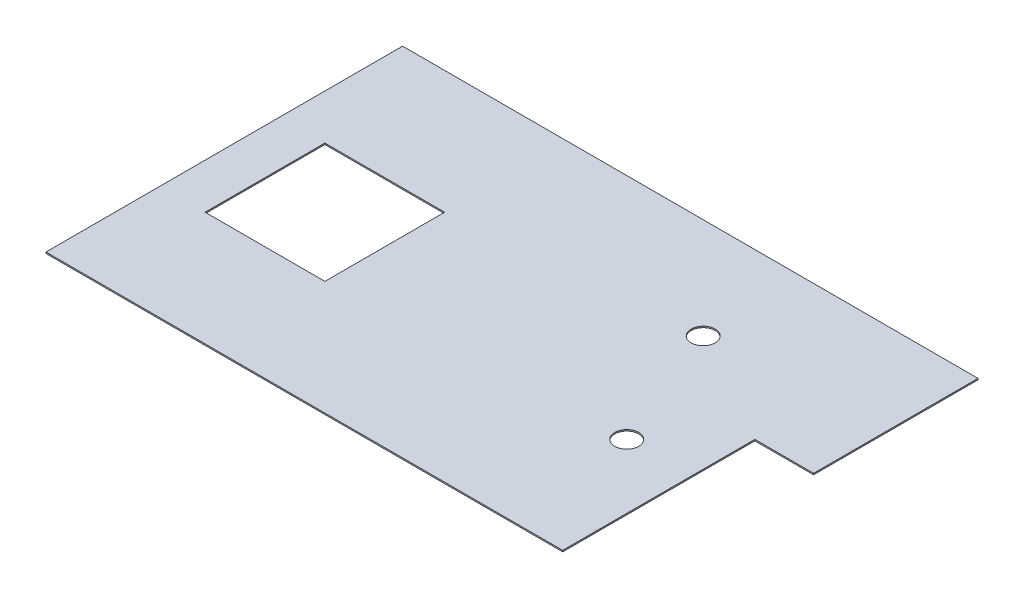
ISO-10303-21;
HEADER;
FILE_DESCRIPTION(('STEP AP214'),'2;1');
FILE_NAME('part.step','',(''),(''),'','','');
FILE_SCHEMA(('AUTOMOTIVE_DESIGN { 1 0 10303 214 1 1 1 1 }'));
ENDSEC;
DATA;
#1=APPLICATION_CONTEXT('core data for automotive mechanical design processes');
#2=APPLICATION_PROTOCOL_DEFINITION('international standard','automotive_design',2000,#1);
#3=PRODUCT_CONTEXT('',#1,'mechanical');
#4=PRODUCT('Part','Part','',(#3));
#5=PRODUCT_RELATED_PRODUCT_CATEGORY('part','',(#4));
#6=PRODUCT_DEFINITION_FORMATION('','',#4);
#7=PRODUCT_DEFINITION_CONTEXT('part definition',#1,'design');
#8=PRODUCT_DEFINITION('design','',#6,#7);
#9=PRODUCT_DEFINITION_SHAPE('','',#8);
#10=(LENGTH_UNIT() NAMED_UNIT(*) SI_UNIT(.MILLI.,.METRE.));
#11=(NAMED_UNIT(*) PLANE_ANGLE_UNIT() SI_UNIT($,.RADIAN.));
#12=(NAMED_UNIT(*) SI_UNIT($,.STERADIAN.) SOLID_ANGLE_UNIT());
#13=UNCERTAINTY_MEASURE_WITH_UNIT(LENGTH_MEASURE(1.E-05),#10,'distance_accuracy_value','');
#14=(GEOMETRIC_REPRESENTATION_CONTEXT(3) GLOBAL_UNCERTAINTY_ASSIGNED_CONTEXT((#13)) GLOBAL_UNIT_ASSIGNED_CONTEXT((#10,
#11,#12)) REPRESENTATION_CONTEXT('',''));
#15=CARTESIAN_POINT('',(0.,0.,0.));
#16=DIRECTION('',(0.,0.,1.));
#17=DIRECTION('',(1.,0.,0.));
#18=AXIS2_PLACEMENT_3D('',#15,#16,#17);
#19=CARTESIAN_POINT('',(0.,6.35,0.));
#20=DIRECTION('',(0.,-1.,0.));
#21=DIRECTION('',(0.,0.,-1.));
#22=AXIS2_PLACEMENT_3D('',#19,#20,#21);
#23=PLANE('',#22);
#24=DIRECTION('',(0.,0.,-1.));
#25=VECTOR('',#24,1.);
#26=CARTESIAN_POINT('',(1369.06,6.35,-66.0400000000002));
#27=LINE('',#26,#25);
#28=CARTESIAN_POINT('',(1369.06,6.35,-66.0400000000002));
#29=VERTEX_POINT('',#28);
#30=CARTESIAN_POINT('',(1369.06,6.35,-848.36));
#31=VERTEX_POINT('',#30);
#32=EDGE_CURVE('E149',#29,#31,#27,.T.);
#33=ORIENTED_EDGE('',*,*,#32,.T.);
#34=DIRECTION('',(-1.,0.,0.));
#35=VECTOR('',#34,1.);
#36=CARTESIAN_POINT('',(-1369.06,6.35,-848.36));
#37=LINE('',#36,#35);
#38=CARTESIAN_POINT('',(-1369.06,6.35,-848.36));
#39=VERTEX_POINT('',#38);
#40=EDGE_CURVE('E152',#31,#39,#37,.T.);
#41=ORIENTED_EDGE('',*,*,#40,.T.);
#42=DIRECTION('',(0.,0.,1.));
#43=VECTOR('',#42,1.);
#44=CARTESIAN_POINT('',(-1369.06,6.35,848.36));
#45=LINE('',#44,#43);
#46=CARTESIAN_POINT('',(-1369.06,6.35,848.36));
#47=VERTEX_POINT('',#46);
#48=EDGE_CURVE('E155',#39,#47,#45,.T.);
#49=ORIENTED_EDGE('',*,*,#48,.T.);
#50=DIRECTION('',(1.,0.,0.));
#51=VECTOR('',#50,1.);
#52=CARTESIAN_POINT('',(-1369.06,6.35,848.36));
#53=LINE('',#52,#51);
#54=CARTESIAN_POINT('',(1089.66,6.35,848.36));
#55=VERTEX_POINT('',#54);
#56=EDGE_CURVE('E157',#47,#55,#53,.T.);
#57=ORIENTED_EDGE('',*,*,#56,.T.);
#58=DIRECTION('',(0.,0.,-1.));
#59=VECTOR('',#58,1.);
#60=CARTESIAN_POINT('',(1089.66,6.35,-66.0400000000002));
#61=LINE('',#60,#59);
#62=CARTESIAN_POINT('',(1089.66,6.35,-66.0400000000002));
#63=VERTEX_POINT('',#62);
#64=EDGE_CURVE('E159',#55,#63,#61,.T.);
#65=ORIENTED_EDGE('',*,*,#64,.T.);
#66=DIRECTION('',(1.,0.,0.));
#67=VECTOR('',#66,1.);
#68=CARTESIAN_POINT('',(1369.06,6.35,-66.0400000000002));
#69=LINE('',#68,#67);
#70=EDGE_CURVE('E161',#63,#29,#69,.T.);
#71=ORIENTED_EDGE('',*,*,#70,.T.);
#72=EDGE_LOOP('',(#33,#41,#49,#57,#65,#71));
#73=FACE_BOUND('',#72,.T.);
#74=DIRECTION('',(0.,0.,-1.));
#75=VECTOR('',#74,1.);
#76=CARTESIAN_POINT('',(-584.454,6.35,-264.16));
#77=LINE('',#76,#75);
#78=CARTESIAN_POINT('',(-584.454,6.35,305.816));
#79=VERTEX_POINT('',#78);
#80=CARTESIAN_POINT('',(-584.454,6.35,-264.16));
#81=VERTEX_POINT('',#80);
#82=EDGE_CURVE('E110',#79,#81,#77,.T.);
#83=ORIENTED_EDGE('',*,*,#82,.F.);
#84=DIRECTION('',(1.,0.,0.));
#85=VECTOR('',#84,1.);
#86=CARTESIAN_POINT('',(-1154.43,6.35,305.816));
#87=LINE('',#86,#85);
#88=CARTESIAN_POINT('',(-1154.43,6.35,305.816));
#89=VERTEX_POINT('',#88);
#90=EDGE_CURVE('E133',#89,#79,#87,.T.);
#91=ORIENTED_EDGE('',*,*,#90,.F.);
#92=DIRECTION('',(0.,0.,1.));
#93=VECTOR('',#92,1.);
#94=CARTESIAN_POINT('',(-1154.43,6.35,-264.16));
#95=LINE('',#94,#93);
#96=CARTESIAN_POINT('',(-1154.43,6.35,-264.16));
#97=VERTEX_POINT('',#96);
#98=EDGE_CURVE('E131',#97,#89,#95,.T.);
#99=ORIENTED_EDGE('',*,*,#98,.F.);
#100=DIRECTION('',(-1.,0.,0.));
#101=VECTOR('',#100,1.);
#102=CARTESIAN_POINT('',(-1154.43,6.35,-264.16));
#103=LINE('',#102,#101);
#104=EDGE_CURVE('E118',#81,#97,#103,.T.);
#105=ORIENTED_EDGE('',*,*,#104,.F.);
#106=EDGE_LOOP('',(#83,#91,#99,#105));
#107=FACE_BOUND('',#106,.T.);
#108=CARTESIAN_POINT('',(540.512,6.35,-369.316));
#109=DIRECTION('',(0.,1.,0.));
#110=DIRECTION('',(0.,0.,1.));
#111=AXIS2_PLACEMENT_3D('',#108,#109,#110);
#112=CIRCLE('',#111,57.15);
#113=CARTESIAN_POINT('',(540.512,6.35,-312.166));
#114=VERTEX_POINT('',#113);
#115=EDGE_CURVE('E139',#114,#114,#112,.T.);
#116=ORIENTED_EDGE('',*,*,#115,.F.);
#117=EDGE_LOOP('',(#116));
#118=FACE_BOUND('',#117,.T.);
#119=CARTESIAN_POINT('',(784.860000000001,6.35,238.76));
#120=DIRECTION('',(0.,1.,0.));
#121=DIRECTION('',(0.,0.,1.));
#122=AXIS2_PLACEMENT_3D('',#119,#120,#121);
#123=CIRCLE('',#122,57.15);
#124=CARTESIAN_POINT('',(784.860000000001,6.35,295.91));
#125=VERTEX_POINT('',#124);
#126=EDGE_CURVE('E254',#125,#125,#123,.T.);
#127=ORIENTED_EDGE('',*,*,#126,.F.);
#128=EDGE_LOOP('',(#127));
#129=FACE_BOUND('',#128,.T.);
#130=ADVANCED_FACE('F33',(#73,#107,#118,#129),#23,.F.);
#131=CARTESIAN_POINT('',(0.,0.,0.));
#132=DIRECTION('',(0.,-1.,0.));
#133=DIRECTION('',(0.,0.,-1.));
#134=AXIS2_PLACEMENT_3D('',#131,#132,#133);
#135=PLANE('',#134);
#136=CARTESIAN_POINT('',(540.512,0.,-369.316));
#137=DIRECTION('',(0.,1.,0.));
#138=DIRECTION('',(0.,0.,1.));
#139=AXIS2_PLACEMENT_3D('',#136,#137,#138);
#140=CIRCLE('',#139,57.15);
#141=CARTESIAN_POINT('',(540.512,0.,-312.166));
#142=VERTEX_POINT('',#141);
#143=EDGE_CURVE('E260',#142,#142,#140,.T.);
#144=ORIENTED_EDGE('',*,*,#143,.T.);
#145=EDGE_LOOP('',(#144));
#146=FACE_BOUND('',#145,.T.);
#147=DIRECTION('',(0.,0.,-1.));
#148=VECTOR('',#147,1.);
#149=CARTESIAN_POINT('',(1369.06,0.,-66.0400000000002));
#150=LINE('',#149,#148);
#151=CARTESIAN_POINT('',(1369.06,0.,-66.0400000000002));
#152=VERTEX_POINT('',#151);
#153=CARTESIAN_POINT('',(1369.06,0.,-848.36));
#154=VERTEX_POINT('',#153);
#155=EDGE_CURVE('E126',#152,#154,#150,.T.);
#156=ORIENTED_EDGE('',*,*,#155,.F.);
#157=DIRECTION('',(1.,0.,0.));
#158=VECTOR('',#157,1.);
#159=CARTESIAN_POINT('',(1369.06,0.,-66.0400000000002));
#160=LINE('',#159,#158);
#161=CARTESIAN_POINT('',(1089.66,0.,-66.0400000000002));
#162=VERTEX_POINT('',#161);
#163=EDGE_CURVE('E153',#162,#152,#160,.T.);
#164=ORIENTED_EDGE('',*,*,#163,.F.);
#165=DIRECTION('',(0.,0.,-1.));
#166=VECTOR('',#165,1.);
#167=CARTESIAN_POINT('',(1089.66,0.,-66.0400000000002));
#168=LINE('',#167,#166);
#169=CARTESIAN_POINT('',(1089.66,0.,848.36));
#170=VERTEX_POINT('',#169);
#171=EDGE_CURVE('E172',#170,#162,#168,.T.);
#172=ORIENTED_EDGE('',*,*,#171,.F.);
#173=DIRECTION('',(1.,0.,0.));
#174=VECTOR('',#173,1.);
#175=CARTESIAN_POINT('',(-1369.06,0.,848.36));
#176=LINE('',#175,#174);
#177=CARTESIAN_POINT('',(-1369.06,0.,848.36));
#178=VERTEX_POINT('',#177);
#179=EDGE_CURVE('E170',#178,#170,#176,.T.);
#180=ORIENTED_EDGE('',*,*,#179,.F.);
#181=DIRECTION('',(0.,0.,1.));
#182=VECTOR('',#181,1.);
#183=CARTESIAN_POINT('',(-1369.06,0.,848.36));
#184=LINE('',#183,#182);
#185=CARTESIAN_POINT('',(-1369.06,0.,-848.36));
#186=VERTEX_POINT('',#185);
#187=EDGE_CURVE('E168',#186,#178,#184,.T.);
#188=ORIENTED_EDGE('',*,*,#187,.F.);
#189=DIRECTION('',(-1.,0.,0.));
#190=VECTOR('',#189,1.);
#191=CARTESIAN_POINT('',(-1369.06,0.,-848.36));
#192=LINE('',#191,#190);
#193=EDGE_CURVE('E166',#154,#186,#192,.T.);
#194=ORIENTED_EDGE('',*,*,#193,.F.);
#195=EDGE_LOOP('',(#156,#164,#172,#180,#188,#194));
#196=FACE_BOUND('',#195,.T.);
#197=DIRECTION('',(1.,0.,0.));
#198=VECTOR('',#197,1.);
#199=CARTESIAN_POINT('',(-1154.43,0.,305.816));
#200=LINE('',#199,#198);
#201=CARTESIAN_POINT('',(-1154.43,0.,305.816));
#202=VERTEX_POINT('',#201);
#203=CARTESIAN_POINT('',(-584.454,0.,305.816));
#204=VERTEX_POINT('',#203);
#205=EDGE_CURVE('E119',#202,#204,#200,.T.);
#206=ORIENTED_EDGE('',*,*,#205,.T.);
#207=DIRECTION('',(0.,0.,-1.));
#208=VECTOR('',#207,1.);
#209=CARTESIAN_POINT('',(-584.454,0.,-264.16));
#210=LINE('',#209,#208);
#211=CARTESIAN_POINT('',(-584.454,0.,-264.16));
#212=VERTEX_POINT('',#211);
#213=EDGE_CURVE('E56',#204,#212,#210,.T.);
#214=ORIENTED_EDGE('',*,*,#213,.T.);
#215=DIRECTION('',(-1.,0.,0.));
#216=VECTOR('',#215,1.);
#217=CARTESIAN_POINT('',(-1154.43,0.,-264.16));
#218=LINE('',#217,#216);
#219=CARTESIAN_POINT('',(-1154.43,0.,-264.16));
#220=VERTEX_POINT('',#219);
#221=EDGE_CURVE('E125',#212,#220,#218,.T.);
#222=ORIENTED_EDGE('',*,*,#221,.T.);
#223=DIRECTION('',(0.,0.,1.));
#224=VECTOR('',#223,1.);
#225=CARTESIAN_POINT('',(-1154.43,0.,-264.16));
#226=LINE('',#225,#224);
#227=EDGE_CURVE('E141',#220,#202,#226,.T.);
#228=ORIENTED_EDGE('',*,*,#227,.T.);
#229=EDGE_LOOP('',(#206,#214,#222,#228));
#230=FACE_BOUND('',#229,.T.);
#231=CARTESIAN_POINT('',(784.860000000001,0.,238.76));
#232=DIRECTION('',(0.,1.,0.));
#233=DIRECTION('',(0.,0.,1.));
#234=AXIS2_PLACEMENT_3D('',#231,#232,#233);
#235=CIRCLE('',#234,57.15);
#236=CARTESIAN_POINT('',(784.860000000001,0.,295.91));
#237=VERTEX_POINT('',#236);
#238=EDGE_CURVE('E257',#237,#237,#235,.T.);
#239=ORIENTED_EDGE('',*,*,#238,.T.);
#240=EDGE_LOOP('',(#239));
#241=FACE_BOUND('',#240,.T.);
#242=ADVANCED_FACE('F196',(#146,#196,#230,#241),#135,.T.);
#243=CARTESIAN_POINT('',(1369.06,6.35,-66.0400000000002));
#244=DIRECTION('',(-1.,0.,0.));
#245=DIRECTION('',(0.,0.,1.));
#246=AXIS2_PLACEMENT_3D('',#243,#244,#245);
#247=PLANE('',#246);
#248=ORIENTED_EDGE('',*,*,#155,.T.);
#249=DIRECTION('',(0.,-1.,0.));
#250=VECTOR('',#249,1.);
#251=CARTESIAN_POINT('',(1369.06,6.35,-848.36));
#252=LINE('',#251,#250);
#253=EDGE_CURVE('E11',#31,#154,#252,.T.);
#254=ORIENTED_EDGE('',*,*,#253,.F.);
#255=ORIENTED_EDGE('',*,*,#32,.F.);
#256=DIRECTION('',(0.,-1.,0.));
#257=VECTOR('',#256,1.);
#258=CARTESIAN_POINT('',(1369.06,6.35,-66.0400000000002));
#259=LINE('',#258,#257);
#260=EDGE_CURVE('E163',#29,#152,#259,.T.);
#261=ORIENTED_EDGE('',*,*,#260,.T.);
#262=EDGE_LOOP('',(#248,#254,#255,#261));
#263=FACE_BOUND('',#262,.T.);
#264=ADVANCED_FACE('F35',(#263),#247,.F.);
#265=CARTESIAN_POINT('',(-1369.06,6.35,-848.36));
#266=DIRECTION('',(0.,0.,1.));
#267=DIRECTION('',(1.,0.,0.));
#268=AXIS2_PLACEMENT_3D('',#265,#266,#267);
#269=PLANE('',#268);
#270=ORIENTED_EDGE('',*,*,#193,.T.);
#271=DIRECTION('',(0.,-1.,0.));
#272=VECTOR('',#271,1.);
#273=CARTESIAN_POINT('',(-1369.06,6.35,-848.36));
#274=LINE('',#273,#272);
#275=EDGE_CURVE('E41',#39,#186,#274,.T.);
#276=ORIENTED_EDGE('',*,*,#275,.F.);
#277=ORIENTED_EDGE('',*,*,#40,.F.);
#278=ORIENTED_EDGE('',*,*,#253,.T.);
#279=EDGE_LOOP('',(#270,#276,#277,#278));
#280=FACE_BOUND('',#279,.T.);
#281=ADVANCED_FACE('F213',(#280),#269,.F.);
#282=CARTESIAN_POINT('',(-1369.06,6.35,848.36));
#283=DIRECTION('',(1.,0.,0.));
#284=DIRECTION('',(0.,0.,-1.));
#285=AXIS2_PLACEMENT_3D('',#282,#283,#284);
#286=PLANE('',#285);
#287=ORIENTED_EDGE('',*,*,#187,.T.);
#288=DIRECTION('',(0.,-1.,0.));
#289=VECTOR('',#288,1.);
#290=CARTESIAN_POINT('',(-1369.06,6.35,848.36));
#291=LINE('',#290,#289);
#292=EDGE_CURVE('E183',#47,#178,#291,.T.);
#293=ORIENTED_EDGE('',*,*,#292,.F.);
#294=ORIENTED_EDGE('',*,*,#48,.F.);
#295=ORIENTED_EDGE('',*,*,#275,.T.);
#296=EDGE_LOOP('',(#287,#293,#294,#295));
#297=FACE_BOUND('',#296,.T.);
#298=ADVANCED_FACE('F190',(#297),#286,.F.);
#299=CARTESIAN_POINT('',(-1369.06,6.35,848.36));
#300=DIRECTION('',(0.,0.,-1.));
#301=DIRECTION('',(-1.,0.,0.));
#302=AXIS2_PLACEMENT_3D('',#299,#300,#301);
#303=PLANE('',#302);
#304=ORIENTED_EDGE('',*,*,#179,.T.);
#305=DIRECTION('',(0.,-1.,0.));
#306=VECTOR('',#305,1.);
#307=CARTESIAN_POINT('',(1089.66,6.35,848.36));
#308=LINE('',#307,#306);
#309=EDGE_CURVE('E180',#55,#170,#308,.T.);
#310=ORIENTED_EDGE('',*,*,#309,.F.);
#311=ORIENTED_EDGE('',*,*,#56,.F.);
#312=ORIENTED_EDGE('',*,*,#292,.T.);
#313=EDGE_LOOP('',(#304,#310,#311,#312));
#314=FACE_BOUND('',#313,.T.);
#315=ADVANCED_FACE('F202',(#314),#303,.F.);
#316=CARTESIAN_POINT('',(1089.66,6.35,-66.0400000000002));
#317=DIRECTION('',(-1.,0.,0.));
#318=DIRECTION('',(0.,0.,1.));
#319=AXIS2_PLACEMENT_3D('',#316,#317,#318);
#320=PLANE('',#319);
#321=ORIENTED_EDGE('',*,*,#171,.T.);
#322=DIRECTION('',(0.,-1.,0.));
#323=VECTOR('',#322,1.);
#324=CARTESIAN_POINT('',(1089.66,6.35,-66.0400000000002));
#325=LINE('',#324,#323);
#326=EDGE_CURVE('E177',#63,#162,#325,.T.);
#327=ORIENTED_EDGE('',*,*,#326,.F.);
#328=ORIENTED_EDGE('',*,*,#64,.F.);
#329=ORIENTED_EDGE('',*,*,#309,.T.);
#330=EDGE_LOOP('',(#321,#327,#328,#329));
#331=FACE_BOUND('',#330,.T.);
#332=ADVANCED_FACE('F206',(#331),#320,.F.);
#333=CARTESIAN_POINT('',(1369.06,6.35,-66.0400000000002));
#334=DIRECTION('',(0.,0.,-1.));
#335=DIRECTION('',(-1.,0.,0.));
#336=AXIS2_PLACEMENT_3D('',#333,#334,#335);
#337=PLANE('',#336);
#338=ORIENTED_EDGE('',*,*,#163,.T.);
#339=ORIENTED_EDGE('',*,*,#260,.F.);
#340=ORIENTED_EDGE('',*,*,#70,.F.);
#341=ORIENTED_EDGE('',*,*,#326,.T.);
#342=EDGE_LOOP('',(#338,#339,#340,#341));
#343=FACE_BOUND('',#342,.T.);
#344=ADVANCED_FACE('F216',(#343),#337,.F.);
#345=CARTESIAN_POINT('',(-584.454,6.35,-264.16));
#346=DIRECTION('',(-1.,0.,0.));
#347=DIRECTION('',(0.,0.,1.));
#348=AXIS2_PLACEMENT_3D('',#345,#346,#347);
#349=PLANE('',#348);
#350=ORIENTED_EDGE('',*,*,#213,.F.);
#351=DIRECTION('',(0.,-1.,0.));
#352=VECTOR('',#351,1.);
#353=CARTESIAN_POINT('',(-584.454,6.35,305.816));
#354=LINE('',#353,#352);
#355=EDGE_CURVE('E114',#79,#204,#354,.T.);
#356=ORIENTED_EDGE('',*,*,#355,.F.);
#357=ORIENTED_EDGE('',*,*,#82,.T.);
#358=DIRECTION('',(0.,-1.,0.));
#359=VECTOR('',#358,1.);
#360=CARTESIAN_POINT('',(-584.454,6.35,-264.16));
#361=LINE('',#360,#359);
#362=EDGE_CURVE('E113',#81,#212,#361,.T.);
#363=ORIENTED_EDGE('',*,*,#362,.T.);
#364=EDGE_LOOP('',(#350,#356,#357,#363));
#365=FACE_BOUND('',#364,.T.);
#366=ADVANCED_FACE('F112',(#365),#349,.T.);
#367=CARTESIAN_POINT('',(-1154.43,6.35,-264.16));
#368=DIRECTION('',(0.,0.,1.));
#369=DIRECTION('',(1.,0.,0.));
#370=AXIS2_PLACEMENT_3D('',#367,#368,#369);
#371=PLANE('',#370);
#372=ORIENTED_EDGE('',*,*,#221,.F.);
#373=ORIENTED_EDGE('',*,*,#362,.F.);
#374=ORIENTED_EDGE('',*,*,#104,.T.);
#375=DIRECTION('',(0.,-1.,0.));
#376=VECTOR('',#375,1.);
#377=CARTESIAN_POINT('',(-1154.43,6.35,-264.16));
#378=LINE('',#377,#376);
#379=EDGE_CURVE('E127',#97,#220,#378,.T.);
#380=ORIENTED_EDGE('',*,*,#379,.T.);
#381=EDGE_LOOP('',(#372,#373,#374,#380));
#382=FACE_BOUND('',#381,.T.);
#383=ADVANCED_FACE('F122',(#382),#371,.T.);
#384=CARTESIAN_POINT('',(-1154.43,6.35,-264.16));
#385=DIRECTION('',(1.,0.,0.));
#386=DIRECTION('',(0.,0.,-1.));
#387=AXIS2_PLACEMENT_3D('',#384,#385,#386);
#388=PLANE('',#387);
#389=ORIENTED_EDGE('',*,*,#227,.F.);
#390=ORIENTED_EDGE('',*,*,#379,.F.);
#391=ORIENTED_EDGE('',*,*,#98,.T.);
#392=DIRECTION('',(0.,-1.,0.));
#393=VECTOR('',#392,1.);
#394=CARTESIAN_POINT('',(-1154.43,6.35,305.816));
#395=LINE('',#394,#393);
#396=EDGE_CURVE('E48',#89,#202,#395,.T.);
#397=ORIENTED_EDGE('',*,*,#396,.T.);
#398=EDGE_LOOP('',(#389,#390,#391,#397));
#399=FACE_BOUND('',#398,.T.);
#400=ADVANCED_FACE('F235',(#399),#388,.T.);
#401=CARTESIAN_POINT('',(-1154.43,6.35,305.816));
#402=DIRECTION('',(0.,0.,-1.));
#403=DIRECTION('',(-1.,0.,0.));
#404=AXIS2_PLACEMENT_3D('',#401,#402,#403);
#405=PLANE('',#404);
#406=ORIENTED_EDGE('',*,*,#205,.F.);
#407=ORIENTED_EDGE('',*,*,#396,.F.);
#408=ORIENTED_EDGE('',*,*,#90,.T.);
#409=ORIENTED_EDGE('',*,*,#355,.T.);
#410=EDGE_LOOP('',(#406,#407,#408,#409));
#411=FACE_BOUND('',#410,.T.);
#412=ADVANCED_FACE('F238',(#411),#405,.T.);
#413=CARTESIAN_POINT('',(540.512,6.35,-369.316));
#414=DIRECTION('',(0.,-1.,0.));
#415=DIRECTION('',(0.,0.,-1.));
#416=AXIS2_PLACEMENT_3D('',#413,#414,#415);
#417=CYLINDRICAL_SURFACE('',#416,57.15);
#418=ORIENTED_EDGE('',*,*,#115,.T.);
#419=EDGE_LOOP('',(#418));
#420=FACE_BOUND('',#419,.T.);
#421=ORIENTED_EDGE('',*,*,#143,.F.);
#422=EDGE_LOOP('',(#421));
#423=FACE_BOUND('',#422,.T.);
#424=ADVANCED_FACE('F242',(#420,#423),#417,.F.);
#425=CARTESIAN_POINT('',(784.860000000001,6.35,238.76));
#426=DIRECTION('',(0.,-1.,0.));
#427=DIRECTION('',(0.,0.,-1.));
#428=AXIS2_PLACEMENT_3D('',#425,#426,#427);
#429=CYLINDRICAL_SURFACE('',#428,57.15);
#430=ORIENTED_EDGE('',*,*,#126,.T.);
#431=EDGE_LOOP('',(#430));
#432=FACE_BOUND('',#431,.T.);
#433=ORIENTED_EDGE('',*,*,#238,.F.);
#434=EDGE_LOOP('',(#433));
#435=FACE_BOUND('',#434,.T.);
#436=ADVANCED_FACE('F245',(#432,#435),#429,.F.);
#437=CLOSED_SHELL('',(#130,#242,#264,#281,#298,#315,#332,#344,#366,#383,#400,#412,#424,#436));
#438=MANIFOLD_SOLID_BREP('B2',#437);
#439=ADVANCED_BREP_SHAPE_REPRESENTATION('',(#18,#438),#14);
#440=SHAPE_DEFINITION_REPRESENTATION(#9,#439);
ENDSEC;
END-ISO-10303-21;
